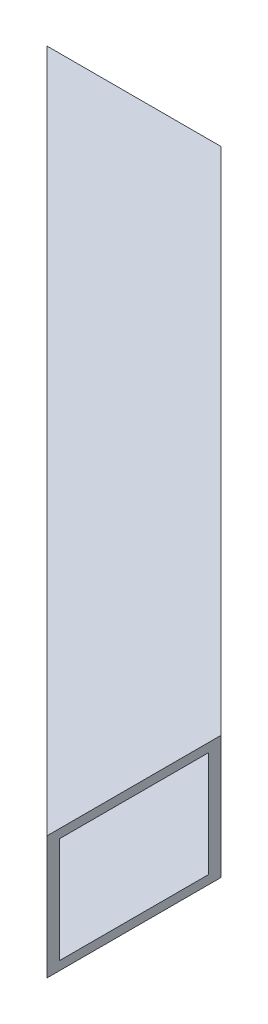
ISO-10303-21;
HEADER;
FILE_DESCRIPTION(('STEP AP214'),'2;1');
FILE_NAME('part.step','',(''),(''),'','','');
FILE_SCHEMA(('AUTOMOTIVE_DESIGN { 1 0 10303 214 1 1 1 1 }'));
ENDSEC;
DATA;
#1=APPLICATION_CONTEXT('core data for automotive mechanical design processes');
#2=APPLICATION_PROTOCOL_DEFINITION('international standard','automotive_design',2000,#1);
#3=PRODUCT_CONTEXT('',#1,'mechanical');
#4=PRODUCT('Part','Part','',(#3));
#5=PRODUCT_RELATED_PRODUCT_CATEGORY('part','',(#4));
#6=PRODUCT_DEFINITION_FORMATION('','',#4);
#7=PRODUCT_DEFINITION_CONTEXT('part definition',#1,'design');
#8=PRODUCT_DEFINITION('design','',#6,#7);
#9=PRODUCT_DEFINITION_SHAPE('','',#8);
#10=(LENGTH_UNIT() NAMED_UNIT(*) SI_UNIT(.MILLI.,.METRE.));
#11=(NAMED_UNIT(*) PLANE_ANGLE_UNIT() SI_UNIT($,.RADIAN.));
#12=(NAMED_UNIT(*) SI_UNIT($,.STERADIAN.) SOLID_ANGLE_UNIT());
#13=UNCERTAINTY_MEASURE_WITH_UNIT(LENGTH_MEASURE(1.E-05),#10,'distance_accuracy_value','');
#14=(GEOMETRIC_REPRESENTATION_CONTEXT(3) GLOBAL_UNCERTAINTY_ASSIGNED_CONTEXT((#13)) GLOBAL_UNIT_ASSIGNED_CONTEXT((#10,
#11,#12)) REPRESENTATION_CONTEXT('',''));
#15=CARTESIAN_POINT('',(0.,0.,0.));
#16=DIRECTION('',(0.,0.,1.));
#17=DIRECTION('',(1.,0.,0.));
#18=AXIS2_PLACEMENT_3D('',#15,#16,#17);
#19=CARTESIAN_POINT('',(571.515907936418,-793.75,139.661158418335));
#20=DIRECTION('',(0.707106781186547,0.,-0.707106781186548));
#21=DIRECTION('',(-0.707106781186548,0.,-0.707106781186547));
#22=AXIS2_PLACEMENT_3D('',#19,#20,#21);
#23=PLANE('',#22);
#24=DIRECTION('',(0.707106781186546,0.,0.70710678118655));
#25=VECTOR('',#24,1.);
#26=CARTESIAN_POINT('',(476.304749518083,-793.75,44.45));
#27=LINE('',#26,#25);
#28=CARTESIAN_POINT('',(476.304749518083,-793.75,44.45));
#29=VERTEX_POINT('',#28);
#30=CARTESIAN_POINT('',(660.4,-793.75,228.545250481918));
#31=VERTEX_POINT('',#30);
#32=EDGE_CURVE('E141',#29,#31,#27,.T.);
#33=ORIENTED_EDGE('',*,*,#32,.T.);
#34=DIRECTION('',(0.,1.,0.));
#35=VECTOR('',#34,1.);
#36=CARTESIAN_POINT('',(660.4,-793.75,228.545250481918));
#37=LINE('',#36,#35);
#38=CARTESIAN_POINT('',(660.4,-838.2,228.545250481918));
#39=VERTEX_POINT('',#38);
#40=EDGE_CURVE('E108',#31,#39,#37,.F.);
#41=ORIENTED_EDGE('',*,*,#40,.T.);
#42=DIRECTION('',(0.707106781186546,0.,0.70710678118655));
#43=VECTOR('',#42,1.);
#44=CARTESIAN_POINT('',(476.304749518083,-838.2,44.45));
#45=LINE('',#44,#43);
#46=CARTESIAN_POINT('',(476.304749518083,-838.2,44.45));
#47=VERTEX_POINT('',#46);
#48=EDGE_CURVE('E111',#47,#39,#45,.T.);
#49=ORIENTED_EDGE('',*,*,#48,.F.);
#50=DIRECTION('',(0.,1.,0.));
#51=VECTOR('',#50,1.);
#52=CARTESIAN_POINT('',(476.304749518083,-793.75,44.45));
#53=LINE('',#52,#51);
#54=EDGE_CURVE('E129',#29,#47,#53,.F.);
#55=ORIENTED_EDGE('',*,*,#54,.F.);
#56=EDGE_LOOP('',(#33,#41,#49,#55));
#57=FACE_BOUND('',#56,.T.);
#58=ADVANCED_FACE('F14',(#57),#23,.T.);
#59=CARTESIAN_POINT('',(544.180045378248,-793.75,170.696960647115));
#60=DIRECTION('',(-0.707106781186547,0.,0.707106781186548));
#61=DIRECTION('',(0.707106781186548,0.,0.707106781186547));
#62=AXIS2_PLACEMENT_3D('',#59,#60,#61);
#63=PLANE('',#62);
#64=DIRECTION('',(0.,1.,0.));
#65=VECTOR('',#64,1.);
#66=CARTESIAN_POINT('',(417.933084731133,-793.75,44.45));
#67=LINE('',#66,#65);
#68=CARTESIAN_POINT('',(417.933084731133,-796.925,44.4500000000001));
#69=VERTEX_POINT('',#68);
#70=CARTESIAN_POINT('',(417.933084731133,-835.025,44.4500000000001));
#71=VERTEX_POINT('',#70);
#72=EDGE_CURVE('E120',#69,#71,#67,.F.);
#73=ORIENTED_EDGE('',*,*,#72,.F.);
#74=DIRECTION('',(-0.707106781186548,0.,-0.707106781186547));
#75=VECTOR('',#74,1.);
#76=CARTESIAN_POINT('',(660.4,-796.925,286.916915268867));
#77=LINE('',#76,#75);
#78=CARTESIAN_POINT('',(660.4,-796.925,286.916915268867));
#79=VERTEX_POINT('',#78);
#80=EDGE_CURVE('E97',#79,#69,#77,.T.);
#81=ORIENTED_EDGE('',*,*,#80,.F.);
#82=DIRECTION('',(0.,1.,0.));
#83=VECTOR('',#82,1.);
#84=CARTESIAN_POINT('',(660.4,-793.75,286.916915268867));
#85=LINE('',#84,#83);
#86=CARTESIAN_POINT('',(660.4,-835.025,286.916915268867));
#87=VERTEX_POINT('',#86);
#88=EDGE_CURVE('E101',#79,#87,#85,.F.);
#89=ORIENTED_EDGE('',*,*,#88,.T.);
#90=DIRECTION('',(-0.707106781186548,0.,-0.707106781186547));
#91=VECTOR('',#90,1.);
#92=CARTESIAN_POINT('',(660.4,-835.025,286.916915268867));
#93=LINE('',#92,#91);
#94=EDGE_CURVE('E17',#87,#71,#93,.T.);
#95=ORIENTED_EDGE('',*,*,#94,.T.);
#96=EDGE_LOOP('',(#73,#81,#89,#95));
#97=FACE_BOUND('',#96,.T.);
#98=ADVANCED_FACE('F118',(#97),#63,.F.);
#99=CARTESIAN_POINT('',(484.1875,-835.025,247.65));
#100=DIRECTION('',(0.,-1.,0.));
#101=DIRECTION('',(0.,0.,-1.));
#102=AXIS2_PLACEMENT_3D('',#99,#100,#101);
#103=PLANE('',#102);
#104=ORIENTED_EDGE('',*,*,#94,.F.);
#105=DIRECTION('',(0.,0.,1.));
#106=VECTOR('',#105,1.);
#107=CARTESIAN_POINT('',(660.4,-835.025,450.85));
#108=LINE('',#107,#106);
#109=CARTESIAN_POINT('',(660.4,-835.025,233.035378542452));
#110=VERTEX_POINT('',#109);
#111=EDGE_CURVE('E103',#87,#110,#108,.F.);
#112=ORIENTED_EDGE('',*,*,#111,.T.);
#113=DIRECTION('',(-0.707106781186548,0.,-0.707106781186547));
#114=VECTOR('',#113,1.);
#115=CARTESIAN_POINT('',(569.270843906151,-835.025,141.906222448602));
#116=LINE('',#115,#114);
#117=CARTESIAN_POINT('',(471.814621457548,-835.025,44.4499999999999));
#118=VERTEX_POINT('',#117);
#119=EDGE_CURVE('E81',#110,#118,#116,.T.);
#120=ORIENTED_EDGE('',*,*,#119,.T.);
#121=DIRECTION('',(-1.,0.,0.));
#122=VECTOR('',#121,1.);
#123=CARTESIAN_POINT('',(430.640205740928,-835.025,44.45));
#124=LINE('',#123,#122);
#125=EDGE_CURVE('E122',#71,#118,#124,.F.);
#126=ORIENTED_EDGE('',*,*,#125,.F.);
#127=EDGE_LOOP('',(#104,#112,#120,#126));
#128=FACE_BOUND('',#127,.T.);
#129=ADVANCED_FACE('F123',(#128),#103,.F.);
#130=CARTESIAN_POINT('',(569.270843906151,-793.75,141.906222448602));
#131=DIRECTION('',(0.707106781186547,0.,-0.707106781186548));
#132=DIRECTION('',(-0.707106781186548,0.,-0.707106781186547));
#133=AXIS2_PLACEMENT_3D('',#130,#131,#132);
#134=PLANE('',#133);
#135=DIRECTION('',(0.,1.,0.));
#136=VECTOR('',#135,1.);
#137=CARTESIAN_POINT('',(660.4,-793.75,233.035378542452));
#138=LINE('',#137,#136);
#139=CARTESIAN_POINT('',(660.4,-796.925,233.035378542452));
#140=VERTEX_POINT('',#139);
#141=EDGE_CURVE('E75',#110,#140,#138,.T.);
#142=ORIENTED_EDGE('',*,*,#141,.T.);
#143=DIRECTION('',(0.707106781186548,0.,0.707106781186547));
#144=VECTOR('',#143,1.);
#145=CARTESIAN_POINT('',(471.814621457548,-796.925,44.45));
#146=LINE('',#145,#144);
#147=CARTESIAN_POINT('',(471.814621457548,-796.925,44.4499999999998));
#148=VERTEX_POINT('',#147);
#149=EDGE_CURVE('E79',#148,#140,#146,.T.);
#150=ORIENTED_EDGE('',*,*,#149,.F.);
#151=DIRECTION('',(0.,1.,0.));
#152=VECTOR('',#151,1.);
#153=CARTESIAN_POINT('',(471.814621457548,-793.75,44.45));
#154=LINE('',#153,#152);
#155=EDGE_CURVE('E125',#118,#148,#154,.T.);
#156=ORIENTED_EDGE('',*,*,#155,.F.);
#157=ORIENTED_EDGE('',*,*,#119,.F.);
#158=EDGE_LOOP('',(#142,#150,#156,#157));
#159=FACE_BOUND('',#158,.T.);
#160=ADVANCED_FACE('F77',(#159),#134,.F.);
#161=CARTESIAN_POINT('',(484.1875,-796.925,247.65));
#162=DIRECTION('',(0.,-1.,0.));
#163=DIRECTION('',(0.,0.,-1.));
#164=AXIS2_PLACEMENT_3D('',#161,#162,#163);
#165=PLANE('',#164);
#166=DIRECTION('',(0.,0.,1.));
#167=VECTOR('',#166,1.);
#168=CARTESIAN_POINT('',(660.4,-796.925,450.85));
#169=LINE('',#168,#167);
#170=EDGE_CURVE('E86',#140,#79,#169,.T.);
#171=ORIENTED_EDGE('',*,*,#170,.T.);
#172=ORIENTED_EDGE('',*,*,#80,.T.);
#173=DIRECTION('',(-1.,0.,0.));
#174=VECTOR('',#173,1.);
#175=CARTESIAN_POINT('',(430.640205740928,-796.925,44.45));
#176=LINE('',#175,#174);
#177=EDGE_CURVE('E95',#148,#69,#176,.T.);
#178=ORIENTED_EDGE('',*,*,#177,.F.);
#179=ORIENTED_EDGE('',*,*,#149,.T.);
#180=EDGE_LOOP('',(#171,#172,#178,#179));
#181=FACE_BOUND('',#180,.T.);
#182=ADVANCED_FACE('F91',(#181),#165,.T.);
#183=CARTESIAN_POINT('',(484.1875,-838.2,247.65));
#184=DIRECTION('',(0.,-1.,0.));
#185=DIRECTION('',(0.,0.,-1.));
#186=AXIS2_PLACEMENT_3D('',#183,#184,#185);
#187=PLANE('',#186);
#188=DIRECTION('',(0.,0.,1.));
#189=VECTOR('',#188,1.);
#190=CARTESIAN_POINT('',(660.4,-838.2,450.85));
#191=LINE('',#190,#189);
#192=CARTESIAN_POINT('',(660.4,-838.2,291.407043329402));
#193=VERTEX_POINT('',#192);
#194=EDGE_CURVE('E87',#39,#193,#191,.T.);
#195=ORIENTED_EDGE('',*,*,#194,.T.);
#196=DIRECTION('',(0.707106781186548,0.,0.707106781186547));
#197=VECTOR('',#196,1.);
#198=CARTESIAN_POINT('',(541.934981347981,-838.2,172.942024677382));
#199=LINE('',#198,#197);
#200=CARTESIAN_POINT('',(413.442956670598,-838.2,44.4499999999999));
#201=VERTEX_POINT('',#200);
#202=EDGE_CURVE('E156',#201,#193,#199,.T.);
#203=ORIENTED_EDGE('',*,*,#202,.F.);
#204=DIRECTION('',(-1.,0.,0.));
#205=VECTOR('',#204,1.);
#206=CARTESIAN_POINT('',(430.640205740928,-838.2,44.45));
#207=LINE('',#206,#205);
#208=EDGE_CURVE('E136',#47,#201,#207,.T.);
#209=ORIENTED_EDGE('',*,*,#208,.F.);
#210=ORIENTED_EDGE('',*,*,#48,.T.);
#211=EDGE_LOOP('',(#195,#203,#209,#210));
#212=FACE_BOUND('',#211,.T.);
#213=ADVANCED_FACE('F162',(#212),#187,.T.);
#214=CARTESIAN_POINT('',(660.4,-793.75,450.85));
#215=DIRECTION('',(-1.,0.,0.));
#216=DIRECTION('',(0.,0.,1.));
#217=AXIS2_PLACEMENT_3D('',#214,#215,#216);
#218=PLANE('',#217);
#219=ORIENTED_EDGE('',*,*,#88,.F.);
#220=ORIENTED_EDGE('',*,*,#170,.F.);
#221=ORIENTED_EDGE('',*,*,#141,.F.);
#222=ORIENTED_EDGE('',*,*,#111,.F.);
#223=EDGE_LOOP('',(#219,#220,#221,#222));
#224=FACE_BOUND('',#223,.T.);
#225=ORIENTED_EDGE('',*,*,#40,.F.);
#226=DIRECTION('',(0.,0.,-1.));
#227=VECTOR('',#226,1.);
#228=CARTESIAN_POINT('',(660.4,-793.75,247.65));
#229=LINE('',#228,#227);
#230=CARTESIAN_POINT('',(660.4,-793.75,291.407043329402));
#231=VERTEX_POINT('',#230);
#232=EDGE_CURVE('E139',#31,#231,#229,.F.);
#233=ORIENTED_EDGE('',*,*,#232,.T.);
#234=DIRECTION('',(0.,1.,0.));
#235=VECTOR('',#234,1.);
#236=CARTESIAN_POINT('',(660.400000000001,-793.75,291.407043329401));
#237=LINE('',#236,#235);
#238=EDGE_CURVE('E152',#193,#231,#237,.T.);
#239=ORIENTED_EDGE('',*,*,#238,.F.);
#240=ORIENTED_EDGE('',*,*,#194,.F.);
#241=EDGE_LOOP('',(#225,#233,#239,#240));
#242=FACE_BOUND('',#241,.T.);
#243=ADVANCED_FACE('F99',(#224,#242),#218,.F.);
#244=CARTESIAN_POINT('',(484.1875,-793.75,247.65));
#245=DIRECTION('',(0.,-1.,0.));
#246=DIRECTION('',(0.,0.,-1.));
#247=AXIS2_PLACEMENT_3D('',#244,#245,#246);
#248=PLANE('',#247);
#249=DIRECTION('',(0.707106781186548,0.,0.707106781186547));
#250=VECTOR('',#249,1.);
#251=CARTESIAN_POINT('',(541.934981347981,-793.75,172.942024677382));
#252=LINE('',#251,#250);
#253=CARTESIAN_POINT('',(413.442956670598,-793.75,44.4499999999999));
#254=VERTEX_POINT('',#253);
#255=EDGE_CURVE('E23',#231,#254,#252,.F.);
#256=ORIENTED_EDGE('',*,*,#255,.F.);
#257=ORIENTED_EDGE('',*,*,#232,.F.);
#258=ORIENTED_EDGE('',*,*,#32,.F.);
#259=DIRECTION('',(-1.,0.,0.));
#260=VECTOR('',#259,1.);
#261=CARTESIAN_POINT('',(430.640205740928,-793.75,44.45));
#262=LINE('',#261,#260);
#263=EDGE_CURVE('E32',#254,#29,#262,.F.);
#264=ORIENTED_EDGE('',*,*,#263,.F.);
#265=EDGE_LOOP('',(#256,#257,#258,#264));
#266=FACE_BOUND('',#265,.T.);
#267=ADVANCED_FACE('F148',(#266),#248,.F.);
#268=CARTESIAN_POINT('',(430.640205740928,-793.75,44.45));
#269=DIRECTION('',(0.,0.,-1.));
#270=DIRECTION('',(-1.,0.,0.));
#271=AXIS2_PLACEMENT_3D('',#268,#269,#270);
#272=PLANE('',#271);
#273=ORIENTED_EDGE('',*,*,#155,.T.);
#274=ORIENTED_EDGE('',*,*,#177,.T.);
#275=ORIENTED_EDGE('',*,*,#72,.T.);
#276=ORIENTED_EDGE('',*,*,#125,.T.);
#277=EDGE_LOOP('',(#273,#274,#275,#276));
#278=FACE_BOUND('',#277,.T.);
#279=ORIENTED_EDGE('',*,*,#263,.T.);
#280=ORIENTED_EDGE('',*,*,#54,.T.);
#281=ORIENTED_EDGE('',*,*,#208,.T.);
#282=DIRECTION('',(0.,1.,0.));
#283=VECTOR('',#282,1.);
#284=CARTESIAN_POINT('',(413.442956670598,-793.75,44.4499999999996));
#285=LINE('',#284,#283);
#286=EDGE_CURVE('E9',#254,#201,#285,.F.);
#287=ORIENTED_EDGE('',*,*,#286,.F.);
#288=EDGE_LOOP('',(#279,#280,#281,#287));
#289=FACE_BOUND('',#288,.T.);
#290=ADVANCED_FACE('F127',(#278,#289),#272,.T.);
#291=CARTESIAN_POINT('',(541.934981347981,-793.75,172.942024677382));
#292=DIRECTION('',(-0.707106781186547,0.,0.707106781186548));
#293=DIRECTION('',(0.707106781186548,0.,0.707106781186547));
#294=AXIS2_PLACEMENT_3D('',#291,#292,#293);
#295=PLANE('',#294);
#296=ORIENTED_EDGE('',*,*,#255,.T.);
#297=ORIENTED_EDGE('',*,*,#286,.T.);
#298=ORIENTED_EDGE('',*,*,#202,.T.);
#299=ORIENTED_EDGE('',*,*,#238,.T.);
#300=EDGE_LOOP('',(#296,#297,#298,#299));
#301=FACE_BOUND('',#300,.T.);
#302=ADVANCED_FACE('F155',(#301),#295,.T.);
#303=CLOSED_SHELL('',(#58,#98,#129,#160,#182,#213,#243,#267,#290,#302));
#304=MANIFOLD_SOLID_BREP('B1',#303);
#305=ADVANCED_BREP_SHAPE_REPRESENTATION('',(#18,#304),#14);
#306=SHAPE_DEFINITION_REPRESENTATION(#9,#305);
ENDSEC;
END-ISO-10303-21;
